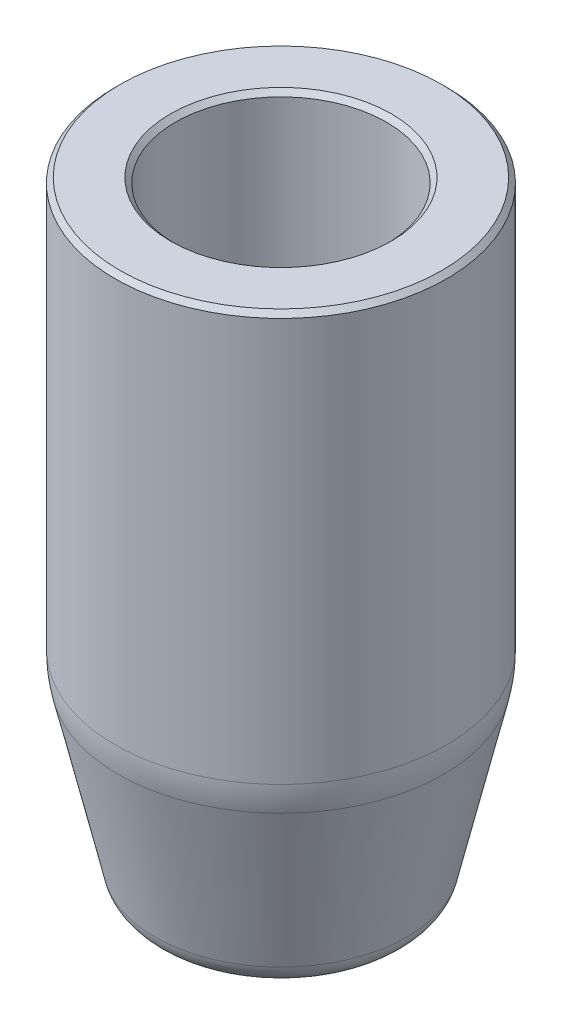
ISO-10303-21;
HEADER;
FILE_DESCRIPTION(('STEP AP214'),'2;1');
FILE_NAME('part.step','',(''),(''),'','','');
FILE_SCHEMA(('AUTOMOTIVE_DESIGN { 1 0 10303 214 1 1 1 1 }'));
ENDSEC;
DATA;
#1=APPLICATION_CONTEXT('core data for automotive mechanical design processes');
#2=APPLICATION_PROTOCOL_DEFINITION('international standard','automotive_design',2000,#1);
#3=PRODUCT_CONTEXT('',#1,'mechanical');
#4=PRODUCT('Part','Part','',(#3));
#5=PRODUCT_RELATED_PRODUCT_CATEGORY('part','',(#4));
#6=PRODUCT_DEFINITION_FORMATION('','',#4);
#7=PRODUCT_DEFINITION_CONTEXT('part definition',#1,'design');
#8=PRODUCT_DEFINITION('design','',#6,#7);
#9=PRODUCT_DEFINITION_SHAPE('','',#8);
#10=(LENGTH_UNIT() NAMED_UNIT(*) SI_UNIT(.MILLI.,.METRE.));
#11=(NAMED_UNIT(*) PLANE_ANGLE_UNIT() SI_UNIT($,.RADIAN.));
#12=(NAMED_UNIT(*) SI_UNIT($,.STERADIAN.) SOLID_ANGLE_UNIT());
#13=UNCERTAINTY_MEASURE_WITH_UNIT(LENGTH_MEASURE(1.E-05),#10,'distance_accuracy_value','');
#14=(GEOMETRIC_REPRESENTATION_CONTEXT(3) GLOBAL_UNCERTAINTY_ASSIGNED_CONTEXT((#13)) GLOBAL_UNIT_ASSIGNED_CONTEXT((#10,
#11,#12)) REPRESENTATION_CONTEXT('',''));
#15=CARTESIAN_POINT('',(0.,0.,0.));
#16=DIRECTION('',(0.,0.,1.));
#17=DIRECTION('',(1.,0.,0.));
#18=AXIS2_PLACEMENT_3D('',#15,#16,#17);
#19=CARTESIAN_POINT('',(2.38125,0.,0.));
#20=DIRECTION('',(0.,1.,0.));
#21=DIRECTION('',(0.,0.,1.));
#22=AXIS2_PLACEMENT_3D('',#19,#20,#21);
#23=PLANE('',#22);
#24=CARTESIAN_POINT('',(0.,0.,0.));
#25=DIRECTION('',(0.,1.,0.));
#26=DIRECTION('',(0.,0.,1.));
#27=AXIS2_PLACEMENT_3D('',#24,#25,#26);
#28=CIRCLE('',#27,2.63525000000001);
#29=CARTESIAN_POINT('',(0.,0.,2.63525000000001));
#30=VERTEX_POINT('',#29);
#31=EDGE_CURVE('E56',#30,#30,#28,.T.);
#32=ORIENTED_EDGE('',*,*,#31,.T.);
#33=EDGE_LOOP('',(#32));
#34=FACE_BOUND('',#33,.T.);
#35=CARTESIAN_POINT('',(0.,0.,0.));
#36=DIRECTION('',(0.,1.,0.));
#37=DIRECTION('',(0.,0.,1.));
#38=AXIS2_PLACEMENT_3D('',#35,#36,#37);
#39=CIRCLE('',#38,5.08712371524611);
#40=CARTESIAN_POINT('',(0.,0.,5.08712371524611));
#41=VERTEX_POINT('',#40);
#42=EDGE_CURVE('E80',#41,#41,#39,.F.);
#43=ORIENTED_EDGE('',*,*,#42,.T.);
#44=EDGE_LOOP('',(#43));
#45=FACE_BOUND('',#44,.T.);
#46=ADVANCED_FACE('F30',(#34,#45),#23,.F.);
#47=CARTESIAN_POINT('',(0.,4.2979985329886,0.));
#48=DIRECTION('',(0.,1.,0.));
#49=DIRECTION('',(0.,0.,1.));
#50=AXIS2_PLACEMENT_3D('',#47,#48,#49);
#51=CYLINDRICAL_SURFACE('',#50,2.38125);
#52=CARTESIAN_POINT('',(0.,2.921,0.));
#53=DIRECTION('',(0.,-1.,0.));
#54=DIRECTION('',(0.,0.,-1.));
#55=AXIS2_PLACEMENT_3D('',#52,#53,#54);
#56=CIRCLE('',#55,2.38125);
#57=CARTESIAN_POINT('',(0.,2.921,-2.38125));
#58=VERTEX_POINT('',#57);
#59=EDGE_CURVE('E62',#58,#58,#56,.F.);
#60=ORIENTED_EDGE('',*,*,#59,.T.);
#61=EDGE_LOOP('',(#60));
#62=FACE_BOUND('',#61,.T.);
#63=CARTESIAN_POINT('',(0.,0.254000000000013,0.));
#64=DIRECTION('',(0.,1.,0.));
#65=DIRECTION('',(0.,0.,1.));
#66=AXIS2_PLACEMENT_3D('',#63,#64,#65);
#67=CIRCLE('',#66,2.38125);
#68=CARTESIAN_POINT('',(0.,0.254000000000013,2.38125));
#69=VERTEX_POINT('',#68);
#70=EDGE_CURVE('E65',#69,#69,#67,.F.);
#71=ORIENTED_EDGE('',*,*,#70,.T.);
#72=EDGE_LOOP('',(#71));
#73=FACE_BOUND('',#72,.T.);
#74=ADVANCED_FACE('F113',(#62,#73),#51,.F.);
#75=CARTESIAN_POINT('',(3.96875,3.175,0.));
#76=DIRECTION('',(0.,-1.,0.));
#77=DIRECTION('',(0.,0.,-1.));
#78=AXIS2_PLACEMENT_3D('',#75,#76,#77);
#79=PLANE('',#78);
#80=CARTESIAN_POINT('',(0.,3.175,0.));
#81=DIRECTION('',(0.,-1.,0.));
#82=DIRECTION('',(0.,0.,-1.));
#83=AXIS2_PLACEMENT_3D('',#80,#81,#82);
#84=CIRCLE('',#83,2.63525000000001);
#85=CARTESIAN_POINT('',(0.,3.175,-2.63525000000001));
#86=VERTEX_POINT('',#85);
#87=EDGE_CURVE('E59',#86,#86,#84,.T.);
#88=ORIENTED_EDGE('',*,*,#87,.T.);
#89=EDGE_LOOP('',(#88));
#90=FACE_BOUND('',#89,.T.);
#91=CARTESIAN_POINT('',(0.,3.175,0.));
#92=DIRECTION('',(0.,-1.,0.));
#93=DIRECTION('',(0.,0.,-1.));
#94=AXIS2_PLACEMENT_3D('',#91,#92,#93);
#95=CIRCLE('',#94,3.175);
#96=CARTESIAN_POINT('',(0.,3.175,-3.175));
#97=VERTEX_POINT('',#96);
#98=EDGE_CURVE('E71',#97,#97,#95,.F.);
#99=ORIENTED_EDGE('',*,*,#98,.T.);
#100=EDGE_LOOP('',(#99));
#101=FACE_BOUND('',#100,.T.);
#102=ADVANCED_FACE('F118',(#90,#101),#79,.F.);
#103=CARTESIAN_POINT('',(0.,4.2979985329886,0.));
#104=DIRECTION('',(0.,1.,0.));
#105=DIRECTION('',(0.,0.,1.));
#106=AXIS2_PLACEMENT_3D('',#103,#104,#105);
#107=CYLINDRICAL_SURFACE('',#106,3.96875);
#108=CARTESIAN_POINT('',(0.,10.06475,0.));
#109=DIRECTION('',(0.,-1.,0.));
#110=DIRECTION('',(0.,0.,-1.));
#111=AXIS2_PLACEMENT_3D('',#108,#109,#110);
#112=CIRCLE('',#111,3.96875);
#113=CARTESIAN_POINT('',(0.,10.06475,-3.96875));
#114=VERTEX_POINT('',#113);
#115=EDGE_CURVE('E37',#114,#114,#112,.F.);
#116=ORIENTED_EDGE('',*,*,#115,.T.);
#117=EDGE_LOOP('',(#116));
#118=FACE_BOUND('',#117,.T.);
#119=CARTESIAN_POINT('',(0.,3.96875,0.));
#120=DIRECTION('',(0.,-1.,0.));
#121=DIRECTION('',(0.,0.,-1.));
#122=AXIS2_PLACEMENT_3D('',#119,#120,#121);
#123=CIRCLE('',#122,3.96875);
#124=CARTESIAN_POINT('',(0.,3.96875,-3.96875));
#125=VERTEX_POINT('',#124);
#126=EDGE_CURVE('E68',#125,#125,#123,.T.);
#127=ORIENTED_EDGE('',*,*,#126,.T.);
#128=EDGE_LOOP('',(#127));
#129=FACE_BOUND('',#128,.T.);
#130=ADVANCED_FACE('F125',(#118,#129),#107,.F.);
#131=CARTESIAN_POINT('',(5.55625,10.31875,0.));
#132=DIRECTION('',(0.,-1.,0.));
#133=DIRECTION('',(0.,0.,-1.));
#134=AXIS2_PLACEMENT_3D('',#131,#132,#133);
#135=PLANE('',#134);
#136=CARTESIAN_POINT('',(0.,10.31875,0.));
#137=DIRECTION('',(0.,-1.,0.));
#138=DIRECTION('',(0.,0.,-1.));
#139=AXIS2_PLACEMENT_3D('',#136,#137,#138);
#140=CIRCLE('',#139,4.22274999999999);
#141=CARTESIAN_POINT('',(0.,10.31875,-4.22274999999999));
#142=VERTEX_POINT('',#141);
#143=EDGE_CURVE('E10',#142,#142,#140,.T.);
#144=ORIENTED_EDGE('',*,*,#143,.T.);
#145=EDGE_LOOP('',(#144));
#146=FACE_BOUND('',#145,.T.);
#147=CARTESIAN_POINT('',(0.,10.31875,0.));
#148=DIRECTION('',(0.,-1.,0.));
#149=DIRECTION('',(0.,0.,-1.));
#150=AXIS2_PLACEMENT_3D('',#147,#148,#149);
#151=CIRCLE('',#150,4.7625);
#152=CARTESIAN_POINT('',(0.,10.31875,-4.7625));
#153=VERTEX_POINT('',#152);
#154=EDGE_CURVE('E77',#153,#153,#151,.F.);
#155=ORIENTED_EDGE('',*,*,#154,.T.);
#156=EDGE_LOOP('',(#155));
#157=FACE_BOUND('',#156,.T.);
#158=ADVANCED_FACE('F129',(#146,#157),#135,.F.);
#159=CARTESIAN_POINT('',(0.,4.2979985329886,0.));
#160=DIRECTION('',(0.,1.,0.));
#161=DIRECTION('',(0.,0.,1.));
#162=AXIS2_PLACEMENT_3D('',#159,#160,#161);
#163=CYLINDRICAL_SURFACE('',#162,5.55625);
#164=CARTESIAN_POINT('',(0.,32.28975,0.));
#165=DIRECTION('',(0.,-1.,0.));
#166=DIRECTION('',(0.,0.,-1.));
#167=AXIS2_PLACEMENT_3D('',#164,#165,#166);
#168=CIRCLE('',#167,5.55625);
#169=CARTESIAN_POINT('',(0.,32.28975,-5.55625));
#170=VERTEX_POINT('',#169);
#171=EDGE_CURVE('E41',#170,#170,#168,.F.);
#172=ORIENTED_EDGE('',*,*,#171,.T.);
#173=EDGE_LOOP('',(#172));
#174=FACE_BOUND('',#173,.T.);
#175=CARTESIAN_POINT('',(0.,11.1125,0.));
#176=DIRECTION('',(0.,-1.,0.));
#177=DIRECTION('',(0.,0.,-1.));
#178=AXIS2_PLACEMENT_3D('',#175,#176,#177);
#179=CIRCLE('',#178,5.55625);
#180=CARTESIAN_POINT('',(0.,11.1125,-5.55625));
#181=VERTEX_POINT('',#180);
#182=EDGE_CURVE('E74',#181,#181,#179,.T.);
#183=ORIENTED_EDGE('',*,*,#182,.T.);
#184=EDGE_LOOP('',(#183));
#185=FACE_BOUND('',#184,.T.);
#186=ADVANCED_FACE('F132',(#174,#185),#163,.F.);
#187=CARTESIAN_POINT('',(8.73125,32.54375,0.));
#188=DIRECTION('',(0.,-1.,0.));
#189=DIRECTION('',(0.,0.,-1.));
#190=AXIS2_PLACEMENT_3D('',#187,#188,#189);
#191=PLANE('',#190);
#192=CARTESIAN_POINT('',(0.,32.54375,0.));
#193=DIRECTION('',(0.,-1.,0.));
#194=DIRECTION('',(0.,0.,-1.));
#195=AXIS2_PLACEMENT_3D('',#192,#193,#194);
#196=CIRCLE('',#195,8.47724999999999);
#197=CARTESIAN_POINT('',(0.,32.54375,-8.47724999999999));
#198=VERTEX_POINT('',#197);
#199=EDGE_CURVE('E50',#198,#198,#196,.F.);
#200=ORIENTED_EDGE('',*,*,#199,.T.);
#201=EDGE_LOOP('',(#200));
#202=FACE_BOUND('',#201,.T.);
#203=CARTESIAN_POINT('',(0.,32.54375,0.));
#204=DIRECTION('',(0.,-1.,0.));
#205=DIRECTION('',(0.,0.,-1.));
#206=AXIS2_PLACEMENT_3D('',#203,#204,#205);
#207=CIRCLE('',#206,5.81024999999999);
#208=CARTESIAN_POINT('',(0.,32.54375,-5.81024999999999));
#209=VERTEX_POINT('',#208);
#210=EDGE_CURVE('E53',#209,#209,#207,.T.);
#211=ORIENTED_EDGE('',*,*,#210,.T.);
#212=EDGE_LOOP('',(#211));
#213=FACE_BOUND('',#212,.T.);
#214=ADVANCED_FACE('F135',(#202,#213),#191,.F.);
#215=CARTESIAN_POINT('',(0.,4.2979985329886,0.));
#216=DIRECTION('',(0.,1.,0.));
#217=DIRECTION('',(0.,0.,1.));
#218=AXIS2_PLACEMENT_3D('',#215,#216,#217);
#219=CYLINDRICAL_SURFACE('',#218,8.73125);
#220=CARTESIAN_POINT('',(0.,32.28975,0.));
#221=DIRECTION('',(0.,-1.,0.));
#222=DIRECTION('',(0.,0.,-1.));
#223=AXIS2_PLACEMENT_3D('',#220,#221,#222);
#224=CIRCLE('',#223,8.73125);
#225=CARTESIAN_POINT('',(0.,32.28975,-8.73125));
#226=VERTEX_POINT('',#225);
#227=EDGE_CURVE('E45',#226,#226,#224,.T.);
#228=ORIENTED_EDGE('',*,*,#227,.T.);
#229=EDGE_LOOP('',(#228));
#230=FACE_BOUND('',#229,.T.);
#231=CARTESIAN_POINT('',(0.,11.0419389357341,0.));
#232=DIRECTION('',(0.,-1.,0.));
#233=DIRECTION('',(0.,0.,-1.));
#234=AXIS2_PLACEMENT_3D('',#231,#232,#233);
#235=CIRCLE('',#234,8.73125);
#236=CARTESIAN_POINT('',(0.,11.0419389357341,-8.73125));
#237=VERTEX_POINT('',#236);
#238=EDGE_CURVE('E89',#237,#237,#235,.F.);
#239=ORIENTED_EDGE('',*,*,#238,.T.);
#240=EDGE_LOOP('',(#239));
#241=FACE_BOUND('',#240,.T.);
#242=ADVANCED_FACE('F93',(#230,#241),#219,.T.);
#243=CARTESIAN_POINT('',(0.,0.,0.));
#244=DIRECTION('',(0.,1.,0.));
#245=DIRECTION('',(0.,0.,1.));
#246=AXIS2_PLACEMENT_3D('',#243,#244,#245);
#247=CONICAL_SURFACE('',#246,6.35,0.226798848053886);
#248=CARTESIAN_POINT('',(0.,1.23053553311572,0.));
#249=DIRECTION('',(0.,-1.,0.));
#250=DIRECTION('',(0.,0.,-1.));
#251=AXIS2_PLACEMENT_3D('',#248,#249,#250);
#252=CIRCLE('',#251,6.63396973841132);
#253=CARTESIAN_POINT('',(0.,1.23053553311572,-6.63396973841132));
#254=VERTEX_POINT('',#253);
#255=EDGE_CURVE('E83',#254,#254,#252,.F.);
#256=ORIENTED_EDGE('',*,*,#255,.T.);
#257=EDGE_LOOP('',(#256));
#258=FACE_BOUND('',#257,.T.);
#259=CARTESIAN_POINT('',(0.,9.61408106819695,0.));
#260=DIRECTION('',(0.,-1.,0.));
#261=DIRECTION('',(0.,0.,-1.));
#262=AXIS2_PLACEMENT_3D('',#259,#260,#261);
#263=CIRCLE('',#262,8.56863409266083);
#264=CARTESIAN_POINT('',(0.,9.61408106819695,-8.56863409266083));
#265=VERTEX_POINT('',#264);
#266=EDGE_CURVE('E86',#265,#265,#263,.T.);
#267=ORIENTED_EDGE('',*,*,#266,.T.);
#268=EDGE_LOOP('',(#267));
#269=FACE_BOUND('',#268,.T.);
#270=ADVANCED_FACE('F98',(#258,#269),#247,.T.);
#271=CARTESIAN_POINT('',(0.,11.0419389357341,0.));
#272=DIRECTION('',(0.,-1.,0.));
#273=DIRECTION('',(0.,0.,-1.));
#274=AXIS2_PLACEMENT_3D('',#271,#272,#273);
#275=DEGENERATE_TOROIDAL_SURFACE('',#274,2.38125,6.35,.T.);
#276=ORIENTED_EDGE('',*,*,#266,.F.);
#277=EDGE_LOOP('',(#276));
#278=FACE_BOUND('',#277,.T.);
#279=ORIENTED_EDGE('',*,*,#238,.F.);
#280=EDGE_LOOP('',(#279));
#281=FACE_BOUND('',#280,.T.);
#282=ADVANCED_FACE('F95',(#278,#281),#275,.T.);
#283=CARTESIAN_POINT('',(0.,1.5875,0.));
#284=DIRECTION('',(0.,1.,0.));
#285=DIRECTION('',(0.,0.,1.));
#286=AXIS2_PLACEMENT_3D('',#283,#284,#285);
#287=TOROIDAL_SURFACE('',#286,5.08712371524611,1.5875);
#288=ORIENTED_EDGE('',*,*,#42,.F.);
#289=EDGE_LOOP('',(#288));
#290=FACE_BOUND('',#289,.T.);
#291=ORIENTED_EDGE('',*,*,#255,.F.);
#292=EDGE_LOOP('',(#291));
#293=FACE_BOUND('',#292,.T.);
#294=ADVANCED_FACE('F97',(#290,#293),#287,.T.);
#295=CARTESIAN_POINT('',(0.,11.1125,0.));
#296=DIRECTION('',(0.,-1.,0.));
#297=DIRECTION('',(0.,0.,-1.));
#298=AXIS2_PLACEMENT_3D('',#295,#296,#297);
#299=TOROIDAL_SURFACE('',#298,4.7625,0.79375);
#300=ORIENTED_EDGE('',*,*,#182,.F.);
#301=EDGE_LOOP('',(#300));
#302=FACE_BOUND('',#301,.T.);
#303=ORIENTED_EDGE('',*,*,#154,.F.);
#304=EDGE_LOOP('',(#303));
#305=FACE_BOUND('',#304,.T.);
#306=ADVANCED_FACE('F105',(#302,#305),#299,.F.);
#307=CARTESIAN_POINT('',(0.,3.96875,0.));
#308=DIRECTION('',(0.,-1.,0.));
#309=DIRECTION('',(0.,0.,-1.));
#310=AXIS2_PLACEMENT_3D('',#307,#308,#309);
#311=TOROIDAL_SURFACE('',#310,3.175,0.79375);
#312=ORIENTED_EDGE('',*,*,#126,.F.);
#313=EDGE_LOOP('',(#312));
#314=FACE_BOUND('',#313,.T.);
#315=ORIENTED_EDGE('',*,*,#98,.F.);
#316=EDGE_LOOP('',(#315));
#317=FACE_BOUND('',#316,.T.);
#318=ADVANCED_FACE('F164',(#314,#317),#311,.F.);
#319=CARTESIAN_POINT('',(0.,2.921,0.));
#320=DIRECTION('',(0.,1.,0.));
#321=DIRECTION('',(0.,0.,1.));
#322=AXIS2_PLACEMENT_3D('',#319,#320,#321);
#323=CONICAL_SURFACE('',#322,2.38125,0.785398163397458);
#324=ORIENTED_EDGE('',*,*,#87,.F.);
#325=EDGE_LOOP('',(#324));
#326=FACE_BOUND('',#325,.T.);
#327=ORIENTED_EDGE('',*,*,#59,.F.);
#328=EDGE_LOOP('',(#327));
#329=FACE_BOUND('',#328,.T.);
#330=ADVANCED_FACE('F171',(#326,#329),#323,.F.);
#331=CARTESIAN_POINT('',(0.,0.,0.));
#332=DIRECTION('',(0.,-1.,0.));
#333=DIRECTION('',(0.,0.,-1.));
#334=AXIS2_PLACEMENT_3D('',#331,#332,#333);
#335=CONICAL_SURFACE('',#334,2.63525000000001,0.785398163397443);
#336=ORIENTED_EDGE('',*,*,#70,.F.);
#337=EDGE_LOOP('',(#336));
#338=FACE_BOUND('',#337,.T.);
#339=ORIENTED_EDGE('',*,*,#31,.F.);
#340=EDGE_LOOP('',(#339));
#341=FACE_BOUND('',#340,.T.);
#342=ADVANCED_FACE('F150',(#338,#341),#335,.F.);
#343=CARTESIAN_POINT('',(0.,32.54375,0.));
#344=DIRECTION('',(0.,-1.,0.));
#345=DIRECTION('',(0.,0.,-1.));
#346=AXIS2_PLACEMENT_3D('',#343,#344,#345);
#347=CONICAL_SURFACE('',#346,8.47724999999999,0.785398163397455);
#348=ORIENTED_EDGE('',*,*,#227,.F.);
#349=EDGE_LOOP('',(#348));
#350=FACE_BOUND('',#349,.T.);
#351=ORIENTED_EDGE('',*,*,#199,.F.);
#352=EDGE_LOOP('',(#351));
#353=FACE_BOUND('',#352,.T.);
#354=ADVANCED_FACE('F146',(#350,#353),#347,.T.);
#355=CARTESIAN_POINT('',(0.,32.28975,0.));
#356=DIRECTION('',(0.,1.,0.));
#357=DIRECTION('',(0.,0.,1.));
#358=AXIS2_PLACEMENT_3D('',#355,#356,#357);
#359=CONICAL_SURFACE('',#358,5.55625,0.785398163397447);
#360=ORIENTED_EDGE('',*,*,#210,.F.);
#361=EDGE_LOOP('',(#360));
#362=FACE_BOUND('',#361,.T.);
#363=ORIENTED_EDGE('',*,*,#171,.F.);
#364=EDGE_LOOP('',(#363));
#365=FACE_BOUND('',#364,.T.);
#366=ADVANCED_FACE('F149',(#362,#365),#359,.F.);
#367=CARTESIAN_POINT('',(0.,10.06475,0.));
#368=DIRECTION('',(0.,1.,0.));
#369=DIRECTION('',(0.,0.,1.));
#370=AXIS2_PLACEMENT_3D('',#367,#368,#369);
#371=CONICAL_SURFACE('',#370,3.96875,0.785398163397458);
#372=ORIENTED_EDGE('',*,*,#143,.F.);
#373=EDGE_LOOP('',(#372));
#374=FACE_BOUND('',#373,.T.);
#375=ORIENTED_EDGE('',*,*,#115,.F.);
#376=EDGE_LOOP('',(#375));
#377=FACE_BOUND('',#376,.T.);
#378=ADVANCED_FACE('F32',(#374,#377),#371,.F.);
#379=CLOSED_SHELL('',(#46,#74,#102,#130,#158,#186,#214,#242,#270,#282,#294,#306,#318,#330,#342,
#354,#366,#378));
#380=MANIFOLD_SOLID_BREP('B2',#379);
#381=ADVANCED_BREP_SHAPE_REPRESENTATION('',(#18,#380),#14);
#382=SHAPE_DEFINITION_REPRESENTATION(#9,#381);
ENDSEC;
END-ISO-10303-21;
